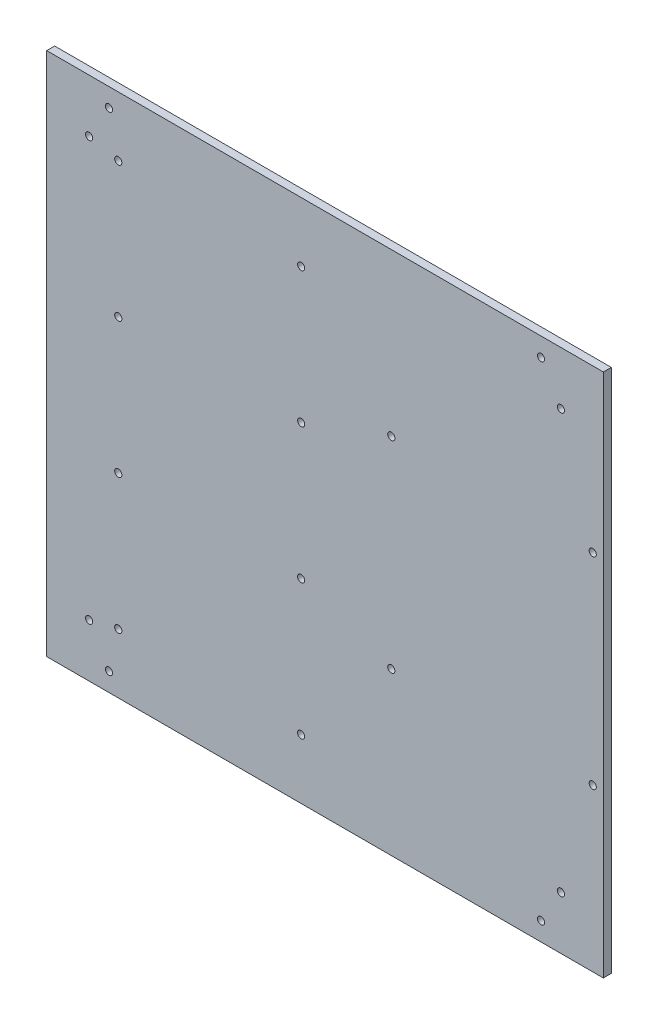
ISO-10303-21;
HEADER;
FILE_DESCRIPTION(('STEP AP214'),'2;1');
FILE_NAME('part.step','',(''),(''),'','','');
FILE_SCHEMA(('AUTOMOTIVE_DESIGN { 1 0 10303 214 1 1 1 1 }'));
ENDSEC;
DATA;
#1=APPLICATION_CONTEXT('core data for automotive mechanical design processes');
#2=APPLICATION_PROTOCOL_DEFINITION('international standard','automotive_design',2000,#1);
#3=PRODUCT_CONTEXT('',#1,'mechanical');
#4=PRODUCT('Part','Part','',(#3));
#5=PRODUCT_RELATED_PRODUCT_CATEGORY('part','',(#4));
#6=PRODUCT_DEFINITION_FORMATION('','',#4);
#7=PRODUCT_DEFINITION_CONTEXT('part definition',#1,'design');
#8=PRODUCT_DEFINITION('design','',#6,#7);
#9=PRODUCT_DEFINITION_SHAPE('','',#8);
#10=(LENGTH_UNIT() NAMED_UNIT(*) SI_UNIT(.MILLI.,.METRE.));
#11=(NAMED_UNIT(*) PLANE_ANGLE_UNIT() SI_UNIT($,.RADIAN.));
#12=(NAMED_UNIT(*) SI_UNIT($,.STERADIAN.) SOLID_ANGLE_UNIT());
#13=UNCERTAINTY_MEASURE_WITH_UNIT(LENGTH_MEASURE(1.E-05),#10,'distance_accuracy_value','');
#14=(GEOMETRIC_REPRESENTATION_CONTEXT(3) GLOBAL_UNCERTAINTY_ASSIGNED_CONTEXT((#13)) GLOBAL_UNIT_ASSIGNED_CONTEXT((#10,
#11,#12)) REPRESENTATION_CONTEXT('',''));
#15=CARTESIAN_POINT('',(0.,0.,0.));
#16=DIRECTION('',(0.,0.,1.));
#17=DIRECTION('',(1.,0.,0.));
#18=AXIS2_PLACEMENT_3D('',#15,#16,#17);
#19=CARTESIAN_POINT('',(105.,99.,3.));
#20=DIRECTION('',(-1.,0.,0.));
#21=DIRECTION('',(0.,-1.,0.));
#22=AXIS2_PLACEMENT_3D('',#19,#20,#21);
#23=PLANE('',#22);
#24=DIRECTION('',(0.,1.,0.));
#25=VECTOR('',#24,1.);
#26=CARTESIAN_POINT('',(105.,99.,0.));
#27=LINE('',#26,#25);
#28=CARTESIAN_POINT('',(105.,-99.,0.));
#29=VERTEX_POINT('',#28);
#30=CARTESIAN_POINT('',(105.,99.,0.));
#31=VERTEX_POINT('',#30);
#32=EDGE_CURVE('E96',#29,#31,#27,.T.);
#33=ORIENTED_EDGE('',*,*,#32,.T.);
#34=DIRECTION('',(0.,0.,-1.));
#35=VECTOR('',#34,1.);
#36=CARTESIAN_POINT('',(105.,99.,3.));
#37=LINE('',#36,#35);
#38=CARTESIAN_POINT('',(105.,99.,3.));
#39=VERTEX_POINT('',#38);
#40=EDGE_CURVE('E11',#39,#31,#37,.T.);
#41=ORIENTED_EDGE('',*,*,#40,.F.);
#42=DIRECTION('',(0.,1.,0.));
#43=VECTOR('',#42,1.);
#44=CARTESIAN_POINT('',(105.,99.,3.));
#45=LINE('',#44,#43);
#46=CARTESIAN_POINT('',(105.,-99.,3.));
#47=VERTEX_POINT('',#46);
#48=EDGE_CURVE('E84',#47,#39,#45,.T.);
#49=ORIENTED_EDGE('',*,*,#48,.F.);
#50=DIRECTION('',(0.,0.,-1.));
#51=VECTOR('',#50,1.);
#52=CARTESIAN_POINT('',(105.,-99.,3.));
#53=LINE('',#52,#51);
#54=EDGE_CURVE('E92',#47,#29,#53,.T.);
#55=ORIENTED_EDGE('',*,*,#54,.T.);
#56=EDGE_LOOP('',(#33,#41,#49,#55));
#57=FACE_BOUND('',#56,.T.);
#58=ADVANCED_FACE('F33',(#57),#23,.F.);
#59=CARTESIAN_POINT('',(-105.,99.,3.));
#60=DIRECTION('',(0.,-1.,0.));
#61=DIRECTION('',(0.,0.,-1.));
#62=AXIS2_PLACEMENT_3D('',#59,#60,#61);
#63=PLANE('',#62);
#64=DIRECTION('',(-1.,0.,0.));
#65=VECTOR('',#64,1.);
#66=CARTESIAN_POINT('',(-105.,99.,0.));
#67=LINE('',#66,#65);
#68=CARTESIAN_POINT('',(-105.,99.,0.));
#69=VERTEX_POINT('',#68);
#70=EDGE_CURVE('E88',#31,#69,#67,.T.);
#71=ORIENTED_EDGE('',*,*,#70,.T.);
#72=DIRECTION('',(0.,0.,-1.));
#73=VECTOR('',#72,1.);
#74=CARTESIAN_POINT('',(-105.,99.,3.));
#75=LINE('',#74,#73);
#76=CARTESIAN_POINT('',(-105.,99.,3.));
#77=VERTEX_POINT('',#76);
#78=EDGE_CURVE('E41',#77,#69,#75,.T.);
#79=ORIENTED_EDGE('',*,*,#78,.F.);
#80=DIRECTION('',(-1.,0.,0.));
#81=VECTOR('',#80,1.);
#82=CARTESIAN_POINT('',(-105.,99.,3.));
#83=LINE('',#82,#81);
#84=EDGE_CURVE('E79',#39,#77,#83,.T.);
#85=ORIENTED_EDGE('',*,*,#84,.F.);
#86=ORIENTED_EDGE('',*,*,#40,.T.);
#87=EDGE_LOOP('',(#71,#79,#85,#86));
#88=FACE_BOUND('',#87,.T.);
#89=ADVANCED_FACE('F87',(#88),#63,.F.);
#90=CARTESIAN_POINT('',(-105.,99.,3.));
#91=DIRECTION('',(1.,0.,0.));
#92=DIRECTION('',(0.,1.,0.));
#93=AXIS2_PLACEMENT_3D('',#90,#91,#92);
#94=PLANE('',#93);
#95=DIRECTION('',(0.,-1.,0.));
#96=VECTOR('',#95,1.);
#97=CARTESIAN_POINT('',(-105.,99.,0.));
#98=LINE('',#97,#96);
#99=CARTESIAN_POINT('',(-105.,-99.,0.));
#100=VERTEX_POINT('',#99);
#101=EDGE_CURVE('E66',#69,#100,#98,.T.);
#102=ORIENTED_EDGE('',*,*,#101,.T.);
#103=DIRECTION('',(0.,0.,-1.));
#104=VECTOR('',#103,1.);
#105=CARTESIAN_POINT('',(-105.,-99.,3.));
#106=LINE('',#105,#104);
#107=CARTESIAN_POINT('',(-105.,-99.,3.));
#108=VERTEX_POINT('',#107);
#109=EDGE_CURVE('E89',#108,#100,#106,.T.);
#110=ORIENTED_EDGE('',*,*,#109,.F.);
#111=DIRECTION('',(0.,-1.,0.));
#112=VECTOR('',#111,1.);
#113=CARTESIAN_POINT('',(-105.,99.,3.));
#114=LINE('',#113,#112);
#115=EDGE_CURVE('E82',#77,#108,#114,.T.);
#116=ORIENTED_EDGE('',*,*,#115,.F.);
#117=ORIENTED_EDGE('',*,*,#78,.T.);
#118=EDGE_LOOP('',(#102,#110,#116,#117));
#119=FACE_BOUND('',#118,.T.);
#120=ADVANCED_FACE('F90',(#119),#94,.F.);
#121=CARTESIAN_POINT('',(-105.,-99.,3.));
#122=DIRECTION('',(0.,1.,0.));
#123=DIRECTION('',(0.,0.,1.));
#124=AXIS2_PLACEMENT_3D('',#121,#122,#123);
#125=PLANE('',#124);
#126=DIRECTION('',(1.,0.,0.));
#127=VECTOR('',#126,1.);
#128=CARTESIAN_POINT('',(-105.,-99.,0.));
#129=LINE('',#128,#127);
#130=EDGE_CURVE('E72',#100,#29,#129,.T.);
#131=ORIENTED_EDGE('',*,*,#130,.T.);
#132=ORIENTED_EDGE('',*,*,#54,.F.);
#133=DIRECTION('',(1.,0.,0.));
#134=VECTOR('',#133,1.);
#135=CARTESIAN_POINT('',(-105.,-99.,3.));
#136=LINE('',#135,#134);
#137=EDGE_CURVE('E49',#108,#47,#136,.T.);
#138=ORIENTED_EDGE('',*,*,#137,.F.);
#139=ORIENTED_EDGE('',*,*,#109,.T.);
#140=EDGE_LOOP('',(#131,#132,#138,#139));
#141=FACE_BOUND('',#140,.T.);
#142=ADVANCED_FACE('F104',(#141),#125,.F.);
#143=CARTESIAN_POINT('',(0.,0.,3.));
#144=DIRECTION('',(0.,0.,1.));
#145=DIRECTION('',(1.,0.,0.));
#146=AXIS2_PLACEMENT_3D('',#143,#144,#145);
#147=PLANE('',#146);
#148=CARTESIAN_POINT('',(-81.5,-92.,3.));
#149=DIRECTION('',(0.,0.,1.));
#150=DIRECTION('',(1.,0.,0.));
#151=AXIS2_PLACEMENT_3D('',#148,#149,#150);
#152=CIRCLE('',#151,1.34999999999999);
#153=CARTESIAN_POINT('',(-80.15,-92.,3.));
#154=VERTEX_POINT('',#153);
#155=EDGE_CURVE('E226',#154,#154,#152,.T.);
#156=ORIENTED_EDGE('',*,*,#155,.F.);
#157=EDGE_LOOP('',(#156));
#158=FACE_BOUND('',#157,.T.);
#159=CARTESIAN_POINT('',(-89.,-79.,3.));
#160=DIRECTION('',(0.,0.,1.));
#161=DIRECTION('',(1.,0.,0.));
#162=AXIS2_PLACEMENT_3D('',#159,#160,#161);
#163=CIRCLE('',#162,1.34999999999999);
#164=CARTESIAN_POINT('',(-87.65,-79.,3.));
#165=VERTEX_POINT('',#164);
#166=EDGE_CURVE('E220',#165,#165,#163,.T.);
#167=ORIENTED_EDGE('',*,*,#166,.F.);
#168=EDGE_LOOP('',(#167));
#169=FACE_BOUND('',#168,.T.);
#170=CARTESIAN_POINT('',(-78.,-76.5,3.));
#171=DIRECTION('',(0.,0.,1.));
#172=DIRECTION('',(1.,0.,0.));
#173=AXIS2_PLACEMENT_3D('',#170,#171,#172);
#174=CIRCLE('',#173,1.34999999999999);
#175=CARTESIAN_POINT('',(-76.65,-76.5,3.));
#176=VERTEX_POINT('',#175);
#177=EDGE_CURVE('E214',#176,#176,#174,.T.);
#178=ORIENTED_EDGE('',*,*,#177,.F.);
#179=EDGE_LOOP('',(#178));
#180=FACE_BOUND('',#179,.T.);
#181=CARTESIAN_POINT('',(-78.0000000000001,-25.5,3.));
#182=DIRECTION('',(0.,0.,1.));
#183=DIRECTION('',(1.,0.,0.));
#184=AXIS2_PLACEMENT_3D('',#181,#182,#183);
#185=CIRCLE('',#184,1.34999999999999);
#186=CARTESIAN_POINT('',(-76.6500000000001,-25.5,3.));
#187=VERTEX_POINT('',#186);
#188=EDGE_CURVE('E208',#187,#187,#185,.T.);
#189=ORIENTED_EDGE('',*,*,#188,.F.);
#190=EDGE_LOOP('',(#189));
#191=FACE_BOUND('',#190,.T.);
#192=CARTESIAN_POINT('',(-9.00000000000001,-76.5,3.));
#193=DIRECTION('',(0.,0.,1.));
#194=DIRECTION('',(1.,0.,0.));
#195=AXIS2_PLACEMENT_3D('',#192,#193,#194);
#196=CIRCLE('',#195,1.34999999999999);
#197=CARTESIAN_POINT('',(-7.65000000000002,-76.5,3.));
#198=VERTEX_POINT('',#197);
#199=EDGE_CURVE('E202',#198,#198,#196,.T.);
#200=ORIENTED_EDGE('',*,*,#199,.F.);
#201=EDGE_LOOP('',(#200));
#202=FACE_BOUND('',#201,.T.);
#203=CARTESIAN_POINT('',(-9.00000000000004,-25.5,3.));
#204=DIRECTION('',(0.,0.,1.));
#205=DIRECTION('',(1.,0.,0.));
#206=AXIS2_PLACEMENT_3D('',#203,#204,#205);
#207=CIRCLE('',#206,1.34999999999999);
#208=CARTESIAN_POINT('',(-7.65000000000005,-25.5,3.));
#209=VERTEX_POINT('',#208);
#210=EDGE_CURVE('E196',#209,#209,#207,.T.);
#211=ORIENTED_EDGE('',*,*,#210,.F.);
#212=EDGE_LOOP('',(#211));
#213=FACE_BOUND('',#212,.T.);
#214=CARTESIAN_POINT('',(-9.00000000000004,25.5,3.));
#215=DIRECTION('',(0.,0.,1.));
#216=DIRECTION('',(1.,0.,0.));
#217=AXIS2_PLACEMENT_3D('',#214,#215,#216);
#218=CIRCLE('',#217,1.34999999999999);
#219=CARTESIAN_POINT('',(-7.65000000000005,25.5,3.));
#220=VERTEX_POINT('',#219);
#221=EDGE_CURVE('E190',#220,#220,#218,.T.);
#222=ORIENTED_EDGE('',*,*,#221,.F.);
#223=EDGE_LOOP('',(#222));
#224=FACE_BOUND('',#223,.T.);
#225=CARTESIAN_POINT('',(-78.0000000000001,25.5,3.));
#226=DIRECTION('',(0.,0.,1.));
#227=DIRECTION('',(1.,0.,0.));
#228=AXIS2_PLACEMENT_3D('',#225,#226,#227);
#229=CIRCLE('',#228,1.34999999999999);
#230=CARTESIAN_POINT('',(-76.6500000000001,25.5,3.));
#231=VERTEX_POINT('',#230);
#232=EDGE_CURVE('E184',#231,#231,#229,.T.);
#233=ORIENTED_EDGE('',*,*,#232,.F.);
#234=EDGE_LOOP('',(#233));
#235=FACE_BOUND('',#234,.T.);
#236=CARTESIAN_POINT('',(-78.,76.5,3.));
#237=DIRECTION('',(0.,0.,1.));
#238=DIRECTION('',(1.,0.,0.));
#239=AXIS2_PLACEMENT_3D('',#236,#237,#238);
#240=CIRCLE('',#239,1.34999999999999);
#241=CARTESIAN_POINT('',(-76.65,76.5,3.));
#242=VERTEX_POINT('',#241);
#243=EDGE_CURVE('E178',#242,#242,#240,.T.);
#244=ORIENTED_EDGE('',*,*,#243,.F.);
#245=EDGE_LOOP('',(#244));
#246=FACE_BOUND('',#245,.T.);
#247=CARTESIAN_POINT('',(-89.,79.,3.));
#248=DIRECTION('',(0.,0.,1.));
#249=DIRECTION('',(1.,0.,0.));
#250=AXIS2_PLACEMENT_3D('',#247,#248,#249);
#251=CIRCLE('',#250,1.34999999999999);
#252=CARTESIAN_POINT('',(-87.65,79.,3.));
#253=VERTEX_POINT('',#252);
#254=EDGE_CURVE('E172',#253,#253,#251,.T.);
#255=ORIENTED_EDGE('',*,*,#254,.F.);
#256=EDGE_LOOP('',(#255));
#257=FACE_BOUND('',#256,.T.);
#258=CARTESIAN_POINT('',(-81.5,92.,3.));
#259=DIRECTION('',(0.,0.,1.));
#260=DIRECTION('',(1.,0.,0.));
#261=AXIS2_PLACEMENT_3D('',#258,#259,#260);
#262=CIRCLE('',#261,1.34999999999999);
#263=CARTESIAN_POINT('',(-80.15,92.,3.));
#264=VERTEX_POINT('',#263);
#265=EDGE_CURVE('E166',#264,#264,#262,.T.);
#266=ORIENTED_EDGE('',*,*,#265,.F.);
#267=EDGE_LOOP('',(#266));
#268=FACE_BOUND('',#267,.T.);
#269=CARTESIAN_POINT('',(25.,38.,3.));
#270=DIRECTION('',(0.,0.,1.));
#271=DIRECTION('',(1.,0.,0.));
#272=AXIS2_PLACEMENT_3D('',#269,#270,#271);
#273=CIRCLE('',#272,1.34999999999999);
#274=CARTESIAN_POINT('',(26.35,38.,3.));
#275=VERTEX_POINT('',#274);
#276=EDGE_CURVE('E160',#275,#275,#273,.T.);
#277=ORIENTED_EDGE('',*,*,#276,.F.);
#278=EDGE_LOOP('',(#277));
#279=FACE_BOUND('',#278,.T.);
#280=CARTESIAN_POINT('',(25.,-38.,3.));
#281=DIRECTION('',(0.,0.,1.));
#282=DIRECTION('',(1.,0.,0.));
#283=AXIS2_PLACEMENT_3D('',#280,#281,#282);
#284=CIRCLE('',#283,1.34999999999999);
#285=CARTESIAN_POINT('',(26.35,-38.,3.));
#286=VERTEX_POINT('',#285);
#287=EDGE_CURVE('E154',#286,#286,#284,.T.);
#288=ORIENTED_EDGE('',*,*,#287,.F.);
#289=EDGE_LOOP('',(#288));
#290=FACE_BOUND('',#289,.T.);
#291=CARTESIAN_POINT('',(101.,-38.,3.));
#292=DIRECTION('',(0.,0.,1.));
#293=DIRECTION('',(1.,0.,0.));
#294=AXIS2_PLACEMENT_3D('',#291,#292,#293);
#295=CIRCLE('',#294,1.34999999999999);
#296=CARTESIAN_POINT('',(102.35,-38.,3.));
#297=VERTEX_POINT('',#296);
#298=EDGE_CURVE('E148',#297,#297,#295,.T.);
#299=ORIENTED_EDGE('',*,*,#298,.F.);
#300=EDGE_LOOP('',(#299));
#301=FACE_BOUND('',#300,.T.);
#302=CARTESIAN_POINT('',(101.,38.,3.));
#303=DIRECTION('',(0.,0.,1.));
#304=DIRECTION('',(1.,0.,0.));
#305=AXIS2_PLACEMENT_3D('',#302,#303,#304);
#306=CIRCLE('',#305,1.34999999999999);
#307=CARTESIAN_POINT('',(102.35,38.,3.));
#308=VERTEX_POINT('',#307);
#309=EDGE_CURVE('E142',#308,#308,#306,.T.);
#310=ORIENTED_EDGE('',*,*,#309,.F.);
#311=EDGE_LOOP('',(#310));
#312=FACE_BOUND('',#311,.T.);
#313=CARTESIAN_POINT('',(89.,79.,3.));
#314=DIRECTION('',(0.,0.,1.));
#315=DIRECTION('',(1.,0.,0.));
#316=AXIS2_PLACEMENT_3D('',#313,#314,#315);
#317=CIRCLE('',#316,1.34999999999999);
#318=CARTESIAN_POINT('',(90.3499999999999,79.,3.));
#319=VERTEX_POINT('',#318);
#320=EDGE_CURVE('E136',#319,#319,#317,.T.);
#321=ORIENTED_EDGE('',*,*,#320,.F.);
#322=EDGE_LOOP('',(#321));
#323=FACE_BOUND('',#322,.T.);
#324=CARTESIAN_POINT('',(81.5,92.,3.));
#325=DIRECTION('',(0.,0.,1.));
#326=DIRECTION('',(1.,0.,0.));
#327=AXIS2_PLACEMENT_3D('',#324,#325,#326);
#328=CIRCLE('',#327,1.34999999999999);
#329=CARTESIAN_POINT('',(82.85,92.,3.));
#330=VERTEX_POINT('',#329);
#331=EDGE_CURVE('E130',#330,#330,#328,.T.);
#332=ORIENTED_EDGE('',*,*,#331,.F.);
#333=EDGE_LOOP('',(#332));
#334=FACE_BOUND('',#333,.T.);
#335=CARTESIAN_POINT('',(81.5,-92.,3.));
#336=DIRECTION('',(0.,0.,1.));
#337=DIRECTION('',(1.,0.,0.));
#338=AXIS2_PLACEMENT_3D('',#335,#336,#337);
#339=CIRCLE('',#338,1.34999999999999);
#340=CARTESIAN_POINT('',(82.85,-92.,3.));
#341=VERTEX_POINT('',#340);
#342=EDGE_CURVE('E124',#341,#341,#339,.T.);
#343=ORIENTED_EDGE('',*,*,#342,.F.);
#344=EDGE_LOOP('',(#343));
#345=FACE_BOUND('',#344,.T.);
#346=CARTESIAN_POINT('',(89.,-79.,3.));
#347=DIRECTION('',(0.,0.,1.));
#348=DIRECTION('',(1.,0.,0.));
#349=AXIS2_PLACEMENT_3D('',#346,#347,#348);
#350=CIRCLE('',#349,1.34999999999999);
#351=CARTESIAN_POINT('',(90.35,-79.,3.));
#352=VERTEX_POINT('',#351);
#353=EDGE_CURVE('E118',#352,#352,#350,.T.);
#354=ORIENTED_EDGE('',*,*,#353,.F.);
#355=EDGE_LOOP('',(#354));
#356=FACE_BOUND('',#355,.T.);
#357=CARTESIAN_POINT('',(-9.00000000000001,76.5,3.));
#358=DIRECTION('',(0.,0.,1.));
#359=DIRECTION('',(1.,0.,0.));
#360=AXIS2_PLACEMENT_3D('',#357,#358,#359);
#361=CIRCLE('',#360,1.34999999999999);
#362=CARTESIAN_POINT('',(-7.65000000000002,76.5,3.));
#363=VERTEX_POINT('',#362);
#364=EDGE_CURVE('E112',#363,#363,#361,.T.);
#365=ORIENTED_EDGE('',*,*,#364,.F.);
#366=EDGE_LOOP('',(#365));
#367=FACE_BOUND('',#366,.T.);
#368=ORIENTED_EDGE('',*,*,#48,.T.);
#369=ORIENTED_EDGE('',*,*,#84,.T.);
#370=ORIENTED_EDGE('',*,*,#115,.T.);
#371=ORIENTED_EDGE('',*,*,#137,.T.);
#372=EDGE_LOOP('',(#368,#369,#370,#371));
#373=FACE_BOUND('',#372,.T.);
#374=ADVANCED_FACE('F80',(#158,#169,#180,#191,#202,#213,#224,#235,#246,#257,#268,#279,#290,#301,
#312,#323,#334,#345,#356,#367,#373),#147,.T.);
#375=CARTESIAN_POINT('',(0.,0.,0.));
#376=DIRECTION('',(0.,0.,1.));
#377=DIRECTION('',(1.,0.,0.));
#378=AXIS2_PLACEMENT_3D('',#375,#376,#377);
#379=PLANE('',#378);
#380=CARTESIAN_POINT('',(-81.5,-92.,0.));
#381=DIRECTION('',(0.,0.,1.));
#382=DIRECTION('',(1.,0.,0.));
#383=AXIS2_PLACEMENT_3D('',#380,#381,#382);
#384=CIRCLE('',#383,1.35);
#385=CARTESIAN_POINT('',(-80.15,-92.,0.));
#386=VERTEX_POINT('',#385);
#387=EDGE_CURVE('E223',#386,#386,#384,.T.);
#388=ORIENTED_EDGE('',*,*,#387,.T.);
#389=EDGE_LOOP('',(#388));
#390=FACE_BOUND('',#389,.T.);
#391=CARTESIAN_POINT('',(-89.,-79.,0.));
#392=DIRECTION('',(0.,0.,1.));
#393=DIRECTION('',(1.,0.,0.));
#394=AXIS2_PLACEMENT_3D('',#391,#392,#393);
#395=CIRCLE('',#394,1.35);
#396=CARTESIAN_POINT('',(-87.65,-79.,0.));
#397=VERTEX_POINT('',#396);
#398=EDGE_CURVE('E217',#397,#397,#395,.T.);
#399=ORIENTED_EDGE('',*,*,#398,.T.);
#400=EDGE_LOOP('',(#399));
#401=FACE_BOUND('',#400,.T.);
#402=CARTESIAN_POINT('',(-78.,-76.5,0.));
#403=DIRECTION('',(0.,0.,1.));
#404=DIRECTION('',(1.,0.,0.));
#405=AXIS2_PLACEMENT_3D('',#402,#403,#404);
#406=CIRCLE('',#405,1.35);
#407=CARTESIAN_POINT('',(-76.65,-76.5,0.));
#408=VERTEX_POINT('',#407);
#409=EDGE_CURVE('E211',#408,#408,#406,.T.);
#410=ORIENTED_EDGE('',*,*,#409,.T.);
#411=EDGE_LOOP('',(#410));
#412=FACE_BOUND('',#411,.T.);
#413=CARTESIAN_POINT('',(-78.0000000000001,-25.5,0.));
#414=DIRECTION('',(0.,0.,1.));
#415=DIRECTION('',(1.,0.,0.));
#416=AXIS2_PLACEMENT_3D('',#413,#414,#415);
#417=CIRCLE('',#416,1.35);
#418=CARTESIAN_POINT('',(-76.65,-25.5,0.));
#419=VERTEX_POINT('',#418);
#420=EDGE_CURVE('E205',#419,#419,#417,.T.);
#421=ORIENTED_EDGE('',*,*,#420,.T.);
#422=EDGE_LOOP('',(#421));
#423=FACE_BOUND('',#422,.T.);
#424=CARTESIAN_POINT('',(-9.00000000000001,-76.5,0.));
#425=DIRECTION('',(0.,0.,1.));
#426=DIRECTION('',(1.,0.,0.));
#427=AXIS2_PLACEMENT_3D('',#424,#425,#426);
#428=CIRCLE('',#427,1.34999999999999);
#429=CARTESIAN_POINT('',(-7.65000000000001,-76.5,0.));
#430=VERTEX_POINT('',#429);
#431=EDGE_CURVE('E199',#430,#430,#428,.T.);
#432=ORIENTED_EDGE('',*,*,#431,.T.);
#433=EDGE_LOOP('',(#432));
#434=FACE_BOUND('',#433,.T.);
#435=CARTESIAN_POINT('',(-9.00000000000004,-25.5,0.));
#436=DIRECTION('',(0.,0.,1.));
#437=DIRECTION('',(1.,0.,0.));
#438=AXIS2_PLACEMENT_3D('',#435,#436,#437);
#439=CIRCLE('',#438,1.34999999999999);
#440=CARTESIAN_POINT('',(-7.65000000000004,-25.5,0.));
#441=VERTEX_POINT('',#440);
#442=EDGE_CURVE('E193',#441,#441,#439,.T.);
#443=ORIENTED_EDGE('',*,*,#442,.T.);
#444=EDGE_LOOP('',(#443));
#445=FACE_BOUND('',#444,.T.);
#446=CARTESIAN_POINT('',(-9.00000000000004,25.5,0.));
#447=DIRECTION('',(0.,0.,1.));
#448=DIRECTION('',(1.,0.,0.));
#449=AXIS2_PLACEMENT_3D('',#446,#447,#448);
#450=CIRCLE('',#449,1.34999999999999);
#451=CARTESIAN_POINT('',(-7.65000000000004,25.5,0.));
#452=VERTEX_POINT('',#451);
#453=EDGE_CURVE('E187',#452,#452,#450,.T.);
#454=ORIENTED_EDGE('',*,*,#453,.T.);
#455=EDGE_LOOP('',(#454));
#456=FACE_BOUND('',#455,.T.);
#457=CARTESIAN_POINT('',(-78.0000000000001,25.5,0.));
#458=DIRECTION('',(0.,0.,1.));
#459=DIRECTION('',(1.,0.,0.));
#460=AXIS2_PLACEMENT_3D('',#457,#458,#459);
#461=CIRCLE('',#460,1.35);
#462=CARTESIAN_POINT('',(-76.65,25.5,0.));
#463=VERTEX_POINT('',#462);
#464=EDGE_CURVE('E181',#463,#463,#461,.T.);
#465=ORIENTED_EDGE('',*,*,#464,.T.);
#466=EDGE_LOOP('',(#465));
#467=FACE_BOUND('',#466,.T.);
#468=CARTESIAN_POINT('',(-78.,76.5,0.));
#469=DIRECTION('',(0.,0.,1.));
#470=DIRECTION('',(1.,0.,0.));
#471=AXIS2_PLACEMENT_3D('',#468,#469,#470);
#472=CIRCLE('',#471,1.35);
#473=CARTESIAN_POINT('',(-76.65,76.5,0.));
#474=VERTEX_POINT('',#473);
#475=EDGE_CURVE('E175',#474,#474,#472,.T.);
#476=ORIENTED_EDGE('',*,*,#475,.T.);
#477=EDGE_LOOP('',(#476));
#478=FACE_BOUND('',#477,.T.);
#479=CARTESIAN_POINT('',(-89.,79.,0.));
#480=DIRECTION('',(0.,0.,1.));
#481=DIRECTION('',(1.,0.,0.));
#482=AXIS2_PLACEMENT_3D('',#479,#480,#481);
#483=CIRCLE('',#482,1.35);
#484=CARTESIAN_POINT('',(-87.65,79.,0.));
#485=VERTEX_POINT('',#484);
#486=EDGE_CURVE('E169',#485,#485,#483,.T.);
#487=ORIENTED_EDGE('',*,*,#486,.T.);
#488=EDGE_LOOP('',(#487));
#489=FACE_BOUND('',#488,.T.);
#490=CARTESIAN_POINT('',(-81.5,92.,0.));
#491=DIRECTION('',(0.,0.,1.));
#492=DIRECTION('',(1.,0.,0.));
#493=AXIS2_PLACEMENT_3D('',#490,#491,#492);
#494=CIRCLE('',#493,1.35);
#495=CARTESIAN_POINT('',(-80.15,92.,0.));
#496=VERTEX_POINT('',#495);
#497=EDGE_CURVE('E163',#496,#496,#494,.T.);
#498=ORIENTED_EDGE('',*,*,#497,.T.);
#499=EDGE_LOOP('',(#498));
#500=FACE_BOUND('',#499,.T.);
#501=CARTESIAN_POINT('',(25.,38.,0.));
#502=DIRECTION('',(0.,0.,1.));
#503=DIRECTION('',(1.,0.,0.));
#504=AXIS2_PLACEMENT_3D('',#501,#502,#503);
#505=CIRCLE('',#504,1.34999999999999);
#506=CARTESIAN_POINT('',(26.35,38.,0.));
#507=VERTEX_POINT('',#506);
#508=EDGE_CURVE('E157',#507,#507,#505,.T.);
#509=ORIENTED_EDGE('',*,*,#508,.T.);
#510=EDGE_LOOP('',(#509));
#511=FACE_BOUND('',#510,.T.);
#512=CARTESIAN_POINT('',(25.,-38.,0.));
#513=DIRECTION('',(0.,0.,1.));
#514=DIRECTION('',(1.,0.,0.));
#515=AXIS2_PLACEMENT_3D('',#512,#513,#514);
#516=CIRCLE('',#515,1.35);
#517=CARTESIAN_POINT('',(26.35,-38.,0.));
#518=VERTEX_POINT('',#517);
#519=EDGE_CURVE('E151',#518,#518,#516,.T.);
#520=ORIENTED_EDGE('',*,*,#519,.T.);
#521=EDGE_LOOP('',(#520));
#522=FACE_BOUND('',#521,.T.);
#523=CARTESIAN_POINT('',(101.,-38.,0.));
#524=DIRECTION('',(0.,0.,1.));
#525=DIRECTION('',(1.,0.,0.));
#526=AXIS2_PLACEMENT_3D('',#523,#524,#525);
#527=CIRCLE('',#526,1.35);
#528=CARTESIAN_POINT('',(102.35,-38.,0.));
#529=VERTEX_POINT('',#528);
#530=EDGE_CURVE('E145',#529,#529,#527,.T.);
#531=ORIENTED_EDGE('',*,*,#530,.T.);
#532=EDGE_LOOP('',(#531));
#533=FACE_BOUND('',#532,.T.);
#534=CARTESIAN_POINT('',(101.,38.,0.));
#535=DIRECTION('',(0.,0.,1.));
#536=DIRECTION('',(1.,0.,0.));
#537=AXIS2_PLACEMENT_3D('',#534,#535,#536);
#538=CIRCLE('',#537,1.35);
#539=CARTESIAN_POINT('',(102.35,38.,0.));
#540=VERTEX_POINT('',#539);
#541=EDGE_CURVE('E139',#540,#540,#538,.T.);
#542=ORIENTED_EDGE('',*,*,#541,.T.);
#543=EDGE_LOOP('',(#542));
#544=FACE_BOUND('',#543,.T.);
#545=CARTESIAN_POINT('',(89.,79.,0.));
#546=DIRECTION('',(0.,0.,1.));
#547=DIRECTION('',(1.,0.,0.));
#548=AXIS2_PLACEMENT_3D('',#545,#546,#547);
#549=CIRCLE('',#548,1.35);
#550=CARTESIAN_POINT('',(90.35,79.,0.));
#551=VERTEX_POINT('',#550);
#552=EDGE_CURVE('E133',#551,#551,#549,.T.);
#553=ORIENTED_EDGE('',*,*,#552,.T.);
#554=EDGE_LOOP('',(#553));
#555=FACE_BOUND('',#554,.T.);
#556=CARTESIAN_POINT('',(81.5,92.,0.));
#557=DIRECTION('',(0.,0.,1.));
#558=DIRECTION('',(1.,0.,0.));
#559=AXIS2_PLACEMENT_3D('',#556,#557,#558);
#560=CIRCLE('',#559,1.35);
#561=CARTESIAN_POINT('',(82.85,92.,0.));
#562=VERTEX_POINT('',#561);
#563=EDGE_CURVE('E127',#562,#562,#560,.T.);
#564=ORIENTED_EDGE('',*,*,#563,.T.);
#565=EDGE_LOOP('',(#564));
#566=FACE_BOUND('',#565,.T.);
#567=CARTESIAN_POINT('',(81.5,-92.,0.));
#568=DIRECTION('',(0.,0.,1.));
#569=DIRECTION('',(1.,0.,0.));
#570=AXIS2_PLACEMENT_3D('',#567,#568,#569);
#571=CIRCLE('',#570,1.35);
#572=CARTESIAN_POINT('',(82.85,-92.,0.));
#573=VERTEX_POINT('',#572);
#574=EDGE_CURVE('E121',#573,#573,#571,.T.);
#575=ORIENTED_EDGE('',*,*,#574,.T.);
#576=EDGE_LOOP('',(#575));
#577=FACE_BOUND('',#576,.T.);
#578=CARTESIAN_POINT('',(89.,-79.,0.));
#579=DIRECTION('',(0.,0.,1.));
#580=DIRECTION('',(1.,0.,0.));
#581=AXIS2_PLACEMENT_3D('',#578,#579,#580);
#582=CIRCLE('',#581,1.35);
#583=CARTESIAN_POINT('',(90.35,-79.,0.));
#584=VERTEX_POINT('',#583);
#585=EDGE_CURVE('E115',#584,#584,#582,.T.);
#586=ORIENTED_EDGE('',*,*,#585,.T.);
#587=EDGE_LOOP('',(#586));
#588=FACE_BOUND('',#587,.T.);
#589=CARTESIAN_POINT('',(-9.00000000000001,76.5,0.));
#590=DIRECTION('',(0.,0.,1.));
#591=DIRECTION('',(1.,0.,0.));
#592=AXIS2_PLACEMENT_3D('',#589,#590,#591);
#593=CIRCLE('',#592,1.34999999999999);
#594=CARTESIAN_POINT('',(-7.65000000000001,76.5,0.));
#595=VERTEX_POINT('',#594);
#596=EDGE_CURVE('E99',#595,#595,#593,.T.);
#597=ORIENTED_EDGE('',*,*,#596,.T.);
#598=EDGE_LOOP('',(#597));
#599=FACE_BOUND('',#598,.T.);
#600=ORIENTED_EDGE('',*,*,#32,.F.);
#601=ORIENTED_EDGE('',*,*,#130,.F.);
#602=ORIENTED_EDGE('',*,*,#101,.F.);
#603=ORIENTED_EDGE('',*,*,#70,.F.);
#604=EDGE_LOOP('',(#600,#601,#602,#603));
#605=FACE_BOUND('',#604,.T.);
#606=ADVANCED_FACE('F107',(#390,#401,#412,#423,#434,#445,#456,#467,#478,#489,#500,#511,#522,
#533,#544,#555,#566,#577,#588,#599,#605),#379,.F.);
#607=CARTESIAN_POINT('',(-9.00000000000001,76.5,3.));
#608=DIRECTION('',(0.,0.,1.));
#609=DIRECTION('',(1.,0.,0.));
#610=AXIS2_PLACEMENT_3D('',#607,#608,#609);
#611=CYLINDRICAL_SURFACE('',#610,1.34999999999999);
#612=ORIENTED_EDGE('',*,*,#596,.F.);
#613=EDGE_LOOP('',(#612));
#614=FACE_BOUND('',#613,.T.);
#615=ORIENTED_EDGE('',*,*,#364,.T.);
#616=EDGE_LOOP('',(#615));
#617=FACE_BOUND('',#616,.T.);
#618=ADVANCED_FACE('F273',(#614,#617),#611,.F.);
#619=CARTESIAN_POINT('',(89.,-79.,3.));
#620=DIRECTION('',(0.,0.,1.));
#621=DIRECTION('',(1.,0.,0.));
#622=AXIS2_PLACEMENT_3D('',#619,#620,#621);
#623=CYLINDRICAL_SURFACE('',#622,1.35);
#624=ORIENTED_EDGE('',*,*,#585,.F.);
#625=EDGE_LOOP('',(#624));
#626=FACE_BOUND('',#625,.T.);
#627=ORIENTED_EDGE('',*,*,#353,.T.);
#628=EDGE_LOOP('',(#627));
#629=FACE_BOUND('',#628,.T.);
#630=ADVANCED_FACE('F275',(#626,#629),#623,.F.);
#631=CARTESIAN_POINT('',(81.5,-92.,3.));
#632=DIRECTION('',(0.,0.,1.));
#633=DIRECTION('',(1.,0.,0.));
#634=AXIS2_PLACEMENT_3D('',#631,#632,#633);
#635=CYLINDRICAL_SURFACE('',#634,1.35);
#636=ORIENTED_EDGE('',*,*,#574,.F.);
#637=EDGE_LOOP('',(#636));
#638=FACE_BOUND('',#637,.T.);
#639=ORIENTED_EDGE('',*,*,#342,.T.);
#640=EDGE_LOOP('',(#639));
#641=FACE_BOUND('',#640,.T.);
#642=ADVANCED_FACE('F282',(#638,#641),#635,.F.);
#643=CARTESIAN_POINT('',(81.5,92.,3.));
#644=DIRECTION('',(0.,0.,1.));
#645=DIRECTION('',(1.,0.,0.));
#646=AXIS2_PLACEMENT_3D('',#643,#644,#645);
#647=CYLINDRICAL_SURFACE('',#646,1.35);
#648=ORIENTED_EDGE('',*,*,#563,.F.);
#649=EDGE_LOOP('',(#648));
#650=FACE_BOUND('',#649,.T.);
#651=ORIENTED_EDGE('',*,*,#331,.T.);
#652=EDGE_LOOP('',(#651));
#653=FACE_BOUND('',#652,.T.);
#654=ADVANCED_FACE('F329',(#650,#653),#647,.F.);
#655=CARTESIAN_POINT('',(89.,79.,3.));
#656=DIRECTION('',(0.,0.,1.));
#657=DIRECTION('',(1.,0.,0.));
#658=AXIS2_PLACEMENT_3D('',#655,#656,#657);
#659=CYLINDRICAL_SURFACE('',#658,1.35);
#660=ORIENTED_EDGE('',*,*,#552,.F.);
#661=EDGE_LOOP('',(#660));
#662=FACE_BOUND('',#661,.T.);
#663=ORIENTED_EDGE('',*,*,#320,.T.);
#664=EDGE_LOOP('',(#663));
#665=FACE_BOUND('',#664,.T.);
#666=ADVANCED_FACE('F339',(#662,#665),#659,.F.);
#667=CARTESIAN_POINT('',(101.,38.,3.));
#668=DIRECTION('',(0.,0.,1.));
#669=DIRECTION('',(1.,0.,0.));
#670=AXIS2_PLACEMENT_3D('',#667,#668,#669);
#671=CYLINDRICAL_SURFACE('',#670,1.35);
#672=ORIENTED_EDGE('',*,*,#541,.F.);
#673=EDGE_LOOP('',(#672));
#674=FACE_BOUND('',#673,.T.);
#675=ORIENTED_EDGE('',*,*,#309,.T.);
#676=EDGE_LOOP('',(#675));
#677=FACE_BOUND('',#676,.T.);
#678=ADVANCED_FACE('F349',(#674,#677),#671,.F.);
#679=CARTESIAN_POINT('',(101.,-38.,3.));
#680=DIRECTION('',(0.,0.,1.));
#681=DIRECTION('',(1.,0.,0.));
#682=AXIS2_PLACEMENT_3D('',#679,#680,#681);
#683=CYLINDRICAL_SURFACE('',#682,1.35);
#684=ORIENTED_EDGE('',*,*,#530,.F.);
#685=EDGE_LOOP('',(#684));
#686=FACE_BOUND('',#685,.T.);
#687=ORIENTED_EDGE('',*,*,#298,.T.);
#688=EDGE_LOOP('',(#687));
#689=FACE_BOUND('',#688,.T.);
#690=ADVANCED_FACE('F359',(#686,#689),#683,.F.);
#691=CARTESIAN_POINT('',(25.,-38.,3.));
#692=DIRECTION('',(0.,0.,1.));
#693=DIRECTION('',(1.,0.,0.));
#694=AXIS2_PLACEMENT_3D('',#691,#692,#693);
#695=CYLINDRICAL_SURFACE('',#694,1.35);
#696=ORIENTED_EDGE('',*,*,#519,.F.);
#697=EDGE_LOOP('',(#696));
#698=FACE_BOUND('',#697,.T.);
#699=ORIENTED_EDGE('',*,*,#287,.T.);
#700=EDGE_LOOP('',(#699));
#701=FACE_BOUND('',#700,.T.);
#702=ADVANCED_FACE('F369',(#698,#701),#695,.F.);
#703=CARTESIAN_POINT('',(25.,38.,3.));
#704=DIRECTION('',(0.,0.,1.));
#705=DIRECTION('',(1.,0.,0.));
#706=AXIS2_PLACEMENT_3D('',#703,#704,#705);
#707=CYLINDRICAL_SURFACE('',#706,1.34999999999999);
#708=ORIENTED_EDGE('',*,*,#508,.F.);
#709=EDGE_LOOP('',(#708));
#710=FACE_BOUND('',#709,.T.);
#711=ORIENTED_EDGE('',*,*,#276,.T.);
#712=EDGE_LOOP('',(#711));
#713=FACE_BOUND('',#712,.T.);
#714=ADVANCED_FACE('F379',(#710,#713),#707,.F.);
#715=CARTESIAN_POINT('',(-81.5,92.,3.));
#716=DIRECTION('',(0.,0.,1.));
#717=DIRECTION('',(1.,0.,0.));
#718=AXIS2_PLACEMENT_3D('',#715,#716,#717);
#719=CYLINDRICAL_SURFACE('',#718,1.35);
#720=ORIENTED_EDGE('',*,*,#497,.F.);
#721=EDGE_LOOP('',(#720));
#722=FACE_BOUND('',#721,.T.);
#723=ORIENTED_EDGE('',*,*,#265,.T.);
#724=EDGE_LOOP('',(#723));
#725=FACE_BOUND('',#724,.T.);
#726=ADVANCED_FACE('F389',(#722,#725),#719,.F.);
#727=CARTESIAN_POINT('',(-89.,79.,3.));
#728=DIRECTION('',(0.,0.,1.));
#729=DIRECTION('',(1.,0.,0.));
#730=AXIS2_PLACEMENT_3D('',#727,#728,#729);
#731=CYLINDRICAL_SURFACE('',#730,1.35);
#732=ORIENTED_EDGE('',*,*,#486,.F.);
#733=EDGE_LOOP('',(#732));
#734=FACE_BOUND('',#733,.T.);
#735=ORIENTED_EDGE('',*,*,#254,.T.);
#736=EDGE_LOOP('',(#735));
#737=FACE_BOUND('',#736,.T.);
#738=ADVANCED_FACE('F399',(#734,#737),#731,.F.);
#739=CARTESIAN_POINT('',(-78.,76.5,3.));
#740=DIRECTION('',(0.,0.,1.));
#741=DIRECTION('',(1.,0.,0.));
#742=AXIS2_PLACEMENT_3D('',#739,#740,#741);
#743=CYLINDRICAL_SURFACE('',#742,1.35);
#744=ORIENTED_EDGE('',*,*,#475,.F.);
#745=EDGE_LOOP('',(#744));
#746=FACE_BOUND('',#745,.T.);
#747=ORIENTED_EDGE('',*,*,#243,.T.);
#748=EDGE_LOOP('',(#747));
#749=FACE_BOUND('',#748,.T.);
#750=ADVANCED_FACE('F409',(#746,#749),#743,.F.);
#751=CARTESIAN_POINT('',(-78.0000000000001,25.5,3.));
#752=DIRECTION('',(0.,0.,1.));
#753=DIRECTION('',(1.,0.,0.));
#754=AXIS2_PLACEMENT_3D('',#751,#752,#753);
#755=CYLINDRICAL_SURFACE('',#754,1.35);
#756=ORIENTED_EDGE('',*,*,#464,.F.);
#757=EDGE_LOOP('',(#756));
#758=FACE_BOUND('',#757,.T.);
#759=ORIENTED_EDGE('',*,*,#232,.T.);
#760=EDGE_LOOP('',(#759));
#761=FACE_BOUND('',#760,.T.);
#762=ADVANCED_FACE('F419',(#758,#761),#755,.F.);
#763=CARTESIAN_POINT('',(-9.00000000000004,25.5,3.));
#764=DIRECTION('',(0.,0.,1.));
#765=DIRECTION('',(1.,0.,0.));
#766=AXIS2_PLACEMENT_3D('',#763,#764,#765);
#767=CYLINDRICAL_SURFACE('',#766,1.34999999999999);
#768=ORIENTED_EDGE('',*,*,#453,.F.);
#769=EDGE_LOOP('',(#768));
#770=FACE_BOUND('',#769,.T.);
#771=ORIENTED_EDGE('',*,*,#221,.T.);
#772=EDGE_LOOP('',(#771));
#773=FACE_BOUND('',#772,.T.);
#774=ADVANCED_FACE('F429',(#770,#773),#767,.F.);
#775=CARTESIAN_POINT('',(-9.00000000000004,-25.5,3.));
#776=DIRECTION('',(0.,0.,1.));
#777=DIRECTION('',(1.,0.,0.));
#778=AXIS2_PLACEMENT_3D('',#775,#776,#777);
#779=CYLINDRICAL_SURFACE('',#778,1.34999999999999);
#780=ORIENTED_EDGE('',*,*,#442,.F.);
#781=EDGE_LOOP('',(#780));
#782=FACE_BOUND('',#781,.T.);
#783=ORIENTED_EDGE('',*,*,#210,.T.);
#784=EDGE_LOOP('',(#783));
#785=FACE_BOUND('',#784,.T.);
#786=ADVANCED_FACE('F439',(#782,#785),#779,.F.);
#787=CARTESIAN_POINT('',(-9.00000000000001,-76.5,3.));
#788=DIRECTION('',(0.,0.,1.));
#789=DIRECTION('',(1.,0.,0.));
#790=AXIS2_PLACEMENT_3D('',#787,#788,#789);
#791=CYLINDRICAL_SURFACE('',#790,1.34999999999999);
#792=ORIENTED_EDGE('',*,*,#431,.F.);
#793=EDGE_LOOP('',(#792));
#794=FACE_BOUND('',#793,.T.);
#795=ORIENTED_EDGE('',*,*,#199,.T.);
#796=EDGE_LOOP('',(#795));
#797=FACE_BOUND('',#796,.T.);
#798=ADVANCED_FACE('F449',(#794,#797),#791,.F.);
#799=CARTESIAN_POINT('',(-78.0000000000001,-25.5,3.));
#800=DIRECTION('',(0.,0.,1.));
#801=DIRECTION('',(1.,0.,0.));
#802=AXIS2_PLACEMENT_3D('',#799,#800,#801);
#803=CYLINDRICAL_SURFACE('',#802,1.35);
#804=ORIENTED_EDGE('',*,*,#420,.F.);
#805=EDGE_LOOP('',(#804));
#806=FACE_BOUND('',#805,.T.);
#807=ORIENTED_EDGE('',*,*,#188,.T.);
#808=EDGE_LOOP('',(#807));
#809=FACE_BOUND('',#808,.T.);
#810=ADVANCED_FACE('F459',(#806,#809),#803,.F.);
#811=CARTESIAN_POINT('',(-78.,-76.5,3.));
#812=DIRECTION('',(0.,0.,1.));
#813=DIRECTION('',(1.,0.,0.));
#814=AXIS2_PLACEMENT_3D('',#811,#812,#813);
#815=CYLINDRICAL_SURFACE('',#814,1.35);
#816=ORIENTED_EDGE('',*,*,#409,.F.);
#817=EDGE_LOOP('',(#816));
#818=FACE_BOUND('',#817,.T.);
#819=ORIENTED_EDGE('',*,*,#177,.T.);
#820=EDGE_LOOP('',(#819));
#821=FACE_BOUND('',#820,.T.);
#822=ADVANCED_FACE('F469',(#818,#821),#815,.F.);
#823=CARTESIAN_POINT('',(-89.,-79.,3.));
#824=DIRECTION('',(0.,0.,1.));
#825=DIRECTION('',(1.,0.,0.));
#826=AXIS2_PLACEMENT_3D('',#823,#824,#825);
#827=CYLINDRICAL_SURFACE('',#826,1.35);
#828=ORIENTED_EDGE('',*,*,#398,.F.);
#829=EDGE_LOOP('',(#828));
#830=FACE_BOUND('',#829,.T.);
#831=ORIENTED_EDGE('',*,*,#166,.T.);
#832=EDGE_LOOP('',(#831));
#833=FACE_BOUND('',#832,.T.);
#834=ADVANCED_FACE('F479',(#830,#833),#827,.F.);
#835=CARTESIAN_POINT('',(-81.5,-92.,3.));
#836=DIRECTION('',(0.,0.,1.));
#837=DIRECTION('',(1.,0.,0.));
#838=AXIS2_PLACEMENT_3D('',#835,#836,#837);
#839=CYLINDRICAL_SURFACE('',#838,1.35);
#840=ORIENTED_EDGE('',*,*,#387,.F.);
#841=EDGE_LOOP('',(#840));
#842=FACE_BOUND('',#841,.T.);
#843=ORIENTED_EDGE('',*,*,#155,.T.);
#844=EDGE_LOOP('',(#843));
#845=FACE_BOUND('',#844,.T.);
#846=ADVANCED_FACE('F230',(#842,#845),#839,.F.);
#847=CLOSED_SHELL('',(#58,#89,#120,#142,#374,#606,#618,#630,#642,#654,#666,#678,#690,#702,#714,
#726,#738,#750,#762,#774,#786,#798,#810,#822,#834,#846));
#848=MANIFOLD_SOLID_BREP('B2',#847);
#849=ADVANCED_BREP_SHAPE_REPRESENTATION('',(#18,#848),#14);
#850=SHAPE_DEFINITION_REPRESENTATION(#9,#849);
ENDSEC;
END-ISO-10303-21;
